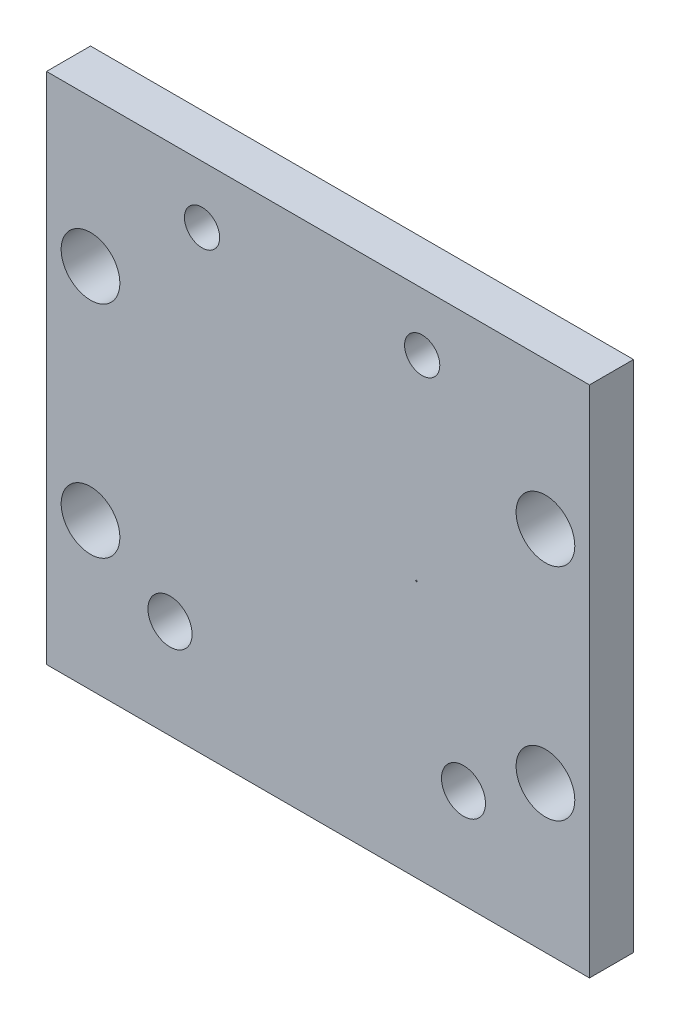
ISO-10303-21;
HEADER;
FILE_DESCRIPTION(('STEP AP214'),'2;1');
FILE_NAME('part.step','',(''),(''),'','','');
FILE_SCHEMA(('AUTOMOTIVE_DESIGN { 1 0 10303 214 1 1 1 1 }'));
ENDSEC;
DATA;
#1=APPLICATION_CONTEXT('core data for automotive mechanical design processes');
#2=APPLICATION_PROTOCOL_DEFINITION('international standard','automotive_design',2000,#1);
#3=PRODUCT_CONTEXT('',#1,'mechanical');
#4=PRODUCT('Part','Part','',(#3));
#5=PRODUCT_RELATED_PRODUCT_CATEGORY('part','',(#4));
#6=PRODUCT_DEFINITION_FORMATION('','',#4);
#7=PRODUCT_DEFINITION_CONTEXT('part definition',#1,'design');
#8=PRODUCT_DEFINITION('design','',#6,#7);
#9=PRODUCT_DEFINITION_SHAPE('','',#8);
#10=(LENGTH_UNIT() NAMED_UNIT(*) SI_UNIT(.MILLI.,.METRE.));
#11=(NAMED_UNIT(*) PLANE_ANGLE_UNIT() SI_UNIT($,.RADIAN.));
#12=(NAMED_UNIT(*) SI_UNIT($,.STERADIAN.) SOLID_ANGLE_UNIT());
#13=UNCERTAINTY_MEASURE_WITH_UNIT(LENGTH_MEASURE(1.E-05),#10,'distance_accuracy_value','');
#14=(GEOMETRIC_REPRESENTATION_CONTEXT(3) GLOBAL_UNCERTAINTY_ASSIGNED_CONTEXT((#13)) GLOBAL_UNIT_ASSIGNED_CONTEXT((#10,
#11,#12)) REPRESENTATION_CONTEXT('',''));
#15=CARTESIAN_POINT('',(0.,0.,0.));
#16=DIRECTION('',(0.,0.,1.));
#17=DIRECTION('',(1.,0.,0.));
#18=AXIS2_PLACEMENT_3D('',#15,#16,#17);
#19=CARTESIAN_POINT('',(0.,0.,3.));
#20=DIRECTION('',(0.,0.,1.));
#21=DIRECTION('',(1.,0.,0.));
#22=AXIS2_PLACEMENT_3D('',#19,#20,#21);
#23=PLANE('',#22);
#24=CARTESIAN_POINT('',(15.530567593757,13.4226152549705,3.));
#25=DIRECTION('',(0.,0.,1.));
#26=DIRECTION('',(1.,0.,0.));
#27=AXIS2_PLACEMENT_3D('',#24,#25,#26);
#28=CIRCLE('',#27,2.00000000000001);
#29=CARTESIAN_POINT('',(17.530567593757,13.4226152549705,3.));
#30=VERTEX_POINT('',#29);
#31=EDGE_CURVE('E251',#30,#30,#28,.T.);
#32=ORIENTED_EDGE('',*,*,#31,.F.);
#33=EDGE_LOOP('',(#32));
#34=FACE_BOUND('',#33,.T.);
#35=CARTESIAN_POINT('',(-15.469432406243,-1.57738474502937,3.));
#36=DIRECTION('',(0.,0.,1.));
#37=DIRECTION('',(1.,0.,0.));
#38=AXIS2_PLACEMENT_3D('',#35,#36,#37);
#39=CIRCLE('',#38,2.);
#40=CARTESIAN_POINT('',(-13.469432406243,-1.57738474502937,3.));
#41=VERTEX_POINT('',#40);
#42=EDGE_CURVE('E239',#41,#41,#39,.T.);
#43=ORIENTED_EDGE('',*,*,#42,.F.);
#44=EDGE_LOOP('',(#43));
#45=FACE_BOUND('',#44,.T.);
#46=CARTESIAN_POINT('',(-10.0520086322193,-4.83112105532809,3.));
#47=DIRECTION('',(0.,0.,1.));
#48=DIRECTION('',(1.,0.,0.));
#49=AXIS2_PLACEMENT_3D('',#46,#47,#48);
#50=CIRCLE('',#49,1.50448530752092);
#51=CARTESIAN_POINT('',(-8.54752332469836,-4.83112105532809,3.));
#52=VERTEX_POINT('',#51);
#53=EDGE_CURVE('E227',#52,#52,#50,.T.);
#54=ORIENTED_EDGE('',*,*,#53,.F.);
#55=EDGE_LOOP('',(#54));
#56=FACE_BOUND('',#55,.T.);
#57=CARTESIAN_POINT('',(6.74024303062548,5.95383545522397,3.));
#58=DIRECTION('',(0.,0.,1.));
#59=DIRECTION('',(1.,0.,0.));
#60=AXIS2_PLACEMENT_3D('',#57,#58,#59);
#61=CIRCLE('',#60,0.0509233955750272);
#62=CARTESIAN_POINT('',(6.79116642620051,5.95383545522397,3.));
#63=VERTEX_POINT('',#62);
#64=EDGE_CURVE('E215',#63,#63,#61,.T.);
#65=ORIENTED_EDGE('',*,*,#64,.F.);
#66=EDGE_LOOP('',(#65));
#67=FACE_BOUND('',#66,.T.);
#68=DIRECTION('',(0.,-1.,0.));
#69=VECTOR('',#68,1.);
#70=CARTESIAN_POINT('',(-18.469432406243,23.4226152549706,3.));
#71=LINE('',#70,#69);
#72=CARTESIAN_POINT('',(-18.469432406243,23.4226152549706,3.));
#73=VERTEX_POINT('',#72);
#74=CARTESIAN_POINT('',(-18.469432406243,-11.5773847450294,3.));
#75=VERTEX_POINT('',#74);
#76=EDGE_CURVE('E185',#73,#75,#71,.T.);
#77=ORIENTED_EDGE('',*,*,#76,.T.);
#78=DIRECTION('',(1.,0.,0.));
#79=VECTOR('',#78,1.);
#80=CARTESIAN_POINT('',(-18.469432406243,-11.5773847450294,3.));
#81=LINE('',#80,#79);
#82=CARTESIAN_POINT('',(18.530567593757,-11.5773847450294,3.));
#83=VERTEX_POINT('',#82);
#84=EDGE_CURVE('E180',#75,#83,#81,.T.);
#85=ORIENTED_EDGE('',*,*,#84,.T.);
#86=DIRECTION('',(0.,1.,0.));
#87=VECTOR('',#86,1.);
#88=CARTESIAN_POINT('',(18.530567593757,23.4226152549706,3.));
#89=LINE('',#88,#87);
#90=CARTESIAN_POINT('',(18.530567593757,23.4226152549706,3.));
#91=VERTEX_POINT('',#90);
#92=EDGE_CURVE('E183',#83,#91,#89,.T.);
#93=ORIENTED_EDGE('',*,*,#92,.T.);
#94=DIRECTION('',(-1.,0.,0.));
#95=VECTOR('',#94,1.);
#96=CARTESIAN_POINT('',(-18.469432406243,23.4226152549706,3.));
#97=LINE('',#96,#95);
#98=EDGE_CURVE('E150',#91,#73,#97,.T.);
#99=ORIENTED_EDGE('',*,*,#98,.T.);
#100=EDGE_LOOP('',(#77,#85,#93,#99));
#101=FACE_BOUND('',#100,.T.);
#102=CARTESIAN_POINT('',(9.94550984229239,-4.827384745008,3.));
#103=DIRECTION('',(0.,0.,1.));
#104=DIRECTION('',(1.,0.,0.));
#105=AXIS2_PLACEMENT_3D('',#102,#103,#104);
#106=CIRCLE('',#105,1.50000000000049);
#107=CARTESIAN_POINT('',(11.4455098422929,-4.827384745008,3.));
#108=VERTEX_POINT('',#107);
#109=EDGE_CURVE('E200',#108,#108,#106,.T.);
#110=ORIENTED_EDGE('',*,*,#109,.F.);
#111=EDGE_LOOP('',(#110));
#112=FACE_BOUND('',#111,.T.);
#113=CARTESIAN_POINT('',(-7.86915790590484,19.50835897612,3.));
#114=DIRECTION('',(0.,0.,1.));
#115=DIRECTION('',(1.,0.,0.));
#116=AXIS2_PLACEMENT_3D('',#113,#114,#115);
#117=CIRCLE('',#116,1.2);
#118=CARTESIAN_POINT('',(-6.66915790590485,19.50835897612,3.));
#119=VERTEX_POINT('',#118);
#120=EDGE_CURVE('E221',#119,#119,#117,.T.);
#121=ORIENTED_EDGE('',*,*,#120,.F.);
#122=EDGE_LOOP('',(#121));
#123=FACE_BOUND('',#122,.T.);
#124=CARTESIAN_POINT('',(7.13080155187816,19.4734839869981,3.));
#125=DIRECTION('',(0.,0.,1.));
#126=DIRECTION('',(1.,0.,0.));
#127=AXIS2_PLACEMENT_3D('',#124,#125,#126);
#128=CIRCLE('',#127,1.2);
#129=CARTESIAN_POINT('',(8.33080155187816,19.4734839869981,3.));
#130=VERTEX_POINT('',#129);
#131=EDGE_CURVE('E233',#130,#130,#128,.T.);
#132=ORIENTED_EDGE('',*,*,#131,.F.);
#133=EDGE_LOOP('',(#132));
#134=FACE_BOUND('',#133,.T.);
#135=CARTESIAN_POINT('',(15.5305675937571,-1.57738474502939,3.));
#136=DIRECTION('',(0.,0.,1.));
#137=DIRECTION('',(1.,0.,0.));
#138=AXIS2_PLACEMENT_3D('',#135,#136,#137);
#139=CIRCLE('',#138,2.);
#140=CARTESIAN_POINT('',(17.5305675937571,-1.57738474502939,3.));
#141=VERTEX_POINT('',#140);
#142=EDGE_CURVE('E245',#141,#141,#139,.T.);
#143=ORIENTED_EDGE('',*,*,#142,.F.);
#144=EDGE_LOOP('',(#143));
#145=FACE_BOUND('',#144,.T.);
#146=CARTESIAN_POINT('',(-15.469432406243,13.4226152549705,3.));
#147=DIRECTION('',(0.,0.,1.));
#148=DIRECTION('',(1.,0.,0.));
#149=AXIS2_PLACEMENT_3D('',#146,#147,#148);
#150=CIRCLE('',#149,2.);
#151=CARTESIAN_POINT('',(-13.469432406243,13.4226152549705,3.));
#152=VERTEX_POINT('',#151);
#153=EDGE_CURVE('E257',#152,#152,#150,.T.);
#154=ORIENTED_EDGE('',*,*,#153,.F.);
#155=EDGE_LOOP('',(#154));
#156=FACE_BOUND('',#155,.T.);
#157=ADVANCED_FACE('F133',(#34,#45,#56,#67,#101,#112,#123,#134,#145,#156),#23,.T.);
#158=CARTESIAN_POINT('',(0.,0.,0.));
#159=DIRECTION('',(0.,0.,1.));
#160=DIRECTION('',(1.,0.,0.));
#161=AXIS2_PLACEMENT_3D('',#158,#159,#160);
#162=PLANE('',#161);
#163=DIRECTION('',(0.,-1.,0.));
#164=VECTOR('',#163,1.);
#165=CARTESIAN_POINT('',(-18.469432406243,23.4226152549706,0.));
#166=LINE('',#165,#164);
#167=CARTESIAN_POINT('',(-18.469432406243,23.4226152549706,0.));
#168=VERTEX_POINT('',#167);
#169=CARTESIAN_POINT('',(-18.469432406243,-11.5773847450294,0.));
#170=VERTEX_POINT('',#169);
#171=EDGE_CURVE('E197',#168,#170,#166,.T.);
#172=ORIENTED_EDGE('',*,*,#171,.F.);
#173=DIRECTION('',(-1.,0.,0.));
#174=VECTOR('',#173,1.);
#175=CARTESIAN_POINT('',(-18.469432406243,23.4226152549706,0.));
#176=LINE('',#175,#174);
#177=CARTESIAN_POINT('',(18.530567593757,23.4226152549706,0.));
#178=VERTEX_POINT('',#177);
#179=EDGE_CURVE('E173',#178,#168,#176,.T.);
#180=ORIENTED_EDGE('',*,*,#179,.F.);
#181=DIRECTION('',(0.,1.,0.));
#182=VECTOR('',#181,1.);
#183=CARTESIAN_POINT('',(18.530567593757,23.4226152549706,0.));
#184=LINE('',#183,#182);
#185=CARTESIAN_POINT('',(18.530567593757,-11.5773847450294,0.));
#186=VERTEX_POINT('',#185);
#187=EDGE_CURVE('E167',#186,#178,#184,.T.);
#188=ORIENTED_EDGE('',*,*,#187,.F.);
#189=DIRECTION('',(1.,0.,0.));
#190=VECTOR('',#189,1.);
#191=CARTESIAN_POINT('',(-18.469432406243,-11.5773847450294,0.));
#192=LINE('',#191,#190);
#193=EDGE_CURVE('E189',#170,#186,#192,.T.);
#194=ORIENTED_EDGE('',*,*,#193,.F.);
#195=EDGE_LOOP('',(#172,#180,#188,#194));
#196=FACE_BOUND('',#195,.T.);
#197=CARTESIAN_POINT('',(9.94550984229239,-4.827384745008,0.));
#198=DIRECTION('',(0.,0.,1.));
#199=DIRECTION('',(1.,0.,0.));
#200=AXIS2_PLACEMENT_3D('',#197,#198,#199);
#201=CIRCLE('',#200,1.50000000000049);
#202=CARTESIAN_POINT('',(11.4455098422929,-4.827384745008,0.));
#203=VERTEX_POINT('',#202);
#204=EDGE_CURVE('E212',#203,#203,#201,.T.);
#205=ORIENTED_EDGE('',*,*,#204,.T.);
#206=EDGE_LOOP('',(#205));
#207=FACE_BOUND('',#206,.T.);
#208=CARTESIAN_POINT('',(6.74024303062548,5.95383545522397,0.));
#209=DIRECTION('',(0.,0.,1.));
#210=DIRECTION('',(1.,0.,0.));
#211=AXIS2_PLACEMENT_3D('',#208,#209,#210);
#212=CIRCLE('',#211,0.0509233955750272);
#213=CARTESIAN_POINT('',(6.79116642620051,5.95383545522397,0.));
#214=VERTEX_POINT('',#213);
#215=EDGE_CURVE('E218',#214,#214,#212,.T.);
#216=ORIENTED_EDGE('',*,*,#215,.T.);
#217=EDGE_LOOP('',(#216));
#218=FACE_BOUND('',#217,.T.);
#219=CARTESIAN_POINT('',(-7.86915790590484,19.50835897612,0.));
#220=DIRECTION('',(0.,0.,1.));
#221=DIRECTION('',(1.,0.,0.));
#222=AXIS2_PLACEMENT_3D('',#219,#220,#221);
#223=CIRCLE('',#222,1.2);
#224=CARTESIAN_POINT('',(-6.66915790590485,19.50835897612,0.));
#225=VERTEX_POINT('',#224);
#226=EDGE_CURVE('E224',#225,#225,#223,.T.);
#227=ORIENTED_EDGE('',*,*,#226,.T.);
#228=EDGE_LOOP('',(#227));
#229=FACE_BOUND('',#228,.T.);
#230=CARTESIAN_POINT('',(-10.0520086322193,-4.83112105532809,0.));
#231=DIRECTION('',(0.,0.,1.));
#232=DIRECTION('',(1.,0.,0.));
#233=AXIS2_PLACEMENT_3D('',#230,#231,#232);
#234=CIRCLE('',#233,1.50448530752092);
#235=CARTESIAN_POINT('',(-8.54752332469836,-4.83112105532809,0.));
#236=VERTEX_POINT('',#235);
#237=EDGE_CURVE('E230',#236,#236,#234,.T.);
#238=ORIENTED_EDGE('',*,*,#237,.T.);
#239=EDGE_LOOP('',(#238));
#240=FACE_BOUND('',#239,.T.);
#241=CARTESIAN_POINT('',(7.13080155187816,19.4734839869981,0.));
#242=DIRECTION('',(0.,0.,1.));
#243=DIRECTION('',(1.,0.,0.));
#244=AXIS2_PLACEMENT_3D('',#241,#242,#243);
#245=CIRCLE('',#244,1.2);
#246=CARTESIAN_POINT('',(8.33080155187816,19.4734839869981,0.));
#247=VERTEX_POINT('',#246);
#248=EDGE_CURVE('E236',#247,#247,#245,.T.);
#249=ORIENTED_EDGE('',*,*,#248,.T.);
#250=EDGE_LOOP('',(#249));
#251=FACE_BOUND('',#250,.T.);
#252=CARTESIAN_POINT('',(-15.469432406243,-1.57738474502937,0.));
#253=DIRECTION('',(0.,0.,1.));
#254=DIRECTION('',(1.,0.,0.));
#255=AXIS2_PLACEMENT_3D('',#252,#253,#254);
#256=CIRCLE('',#255,2.);
#257=CARTESIAN_POINT('',(-13.469432406243,-1.57738474502937,0.));
#258=VERTEX_POINT('',#257);
#259=EDGE_CURVE('E242',#258,#258,#256,.T.);
#260=ORIENTED_EDGE('',*,*,#259,.T.);
#261=EDGE_LOOP('',(#260));
#262=FACE_BOUND('',#261,.T.);
#263=CARTESIAN_POINT('',(15.5305675937571,-1.57738474502939,0.));
#264=DIRECTION('',(0.,0.,1.));
#265=DIRECTION('',(1.,0.,0.));
#266=AXIS2_PLACEMENT_3D('',#263,#264,#265);
#267=CIRCLE('',#266,2.);
#268=CARTESIAN_POINT('',(17.5305675937571,-1.57738474502939,0.));
#269=VERTEX_POINT('',#268);
#270=EDGE_CURVE('E248',#269,#269,#267,.T.);
#271=ORIENTED_EDGE('',*,*,#270,.T.);
#272=EDGE_LOOP('',(#271));
#273=FACE_BOUND('',#272,.T.);
#274=CARTESIAN_POINT('',(15.530567593757,13.4226152549705,0.));
#275=DIRECTION('',(0.,0.,1.));
#276=DIRECTION('',(1.,0.,0.));
#277=AXIS2_PLACEMENT_3D('',#274,#275,#276);
#278=CIRCLE('',#277,2.00000000000001);
#279=CARTESIAN_POINT('',(17.530567593757,13.4226152549705,0.));
#280=VERTEX_POINT('',#279);
#281=EDGE_CURVE('E254',#280,#280,#278,.T.);
#282=ORIENTED_EDGE('',*,*,#281,.T.);
#283=EDGE_LOOP('',(#282));
#284=FACE_BOUND('',#283,.T.);
#285=CARTESIAN_POINT('',(-15.469432406243,13.4226152549705,0.));
#286=DIRECTION('',(0.,0.,1.));
#287=DIRECTION('',(1.,0.,0.));
#288=AXIS2_PLACEMENT_3D('',#285,#286,#287);
#289=CIRCLE('',#288,2.);
#290=CARTESIAN_POINT('',(-13.469432406243,13.4226152549705,0.));
#291=VERTEX_POINT('',#290);
#292=EDGE_CURVE('E260',#291,#291,#289,.T.);
#293=ORIENTED_EDGE('',*,*,#292,.T.);
#294=EDGE_LOOP('',(#293));
#295=FACE_BOUND('',#294,.T.);
#296=ADVANCED_FACE('F208',(#196,#207,#218,#229,#240,#251,#262,#273,#284,#295),#162,.F.);
#297=CARTESIAN_POINT('',(-18.469432406243,23.4226152549706,3.));
#298=DIRECTION('',(1.,0.,0.));
#299=DIRECTION('',(0.,1.,0.));
#300=AXIS2_PLACEMENT_3D('',#297,#298,#299);
#301=PLANE('',#300);
#302=ORIENTED_EDGE('',*,*,#171,.T.);
#303=DIRECTION('',(0.,0.,-1.));
#304=VECTOR('',#303,1.);
#305=CARTESIAN_POINT('',(-18.469432406243,-11.5773847450294,3.));
#306=LINE('',#305,#304);
#307=EDGE_CURVE('E13',#75,#170,#306,.T.);
#308=ORIENTED_EDGE('',*,*,#307,.F.);
#309=ORIENTED_EDGE('',*,*,#76,.F.);
#310=DIRECTION('',(0.,0.,-1.));
#311=VECTOR('',#310,1.);
#312=CARTESIAN_POINT('',(-18.469432406243,23.4226152549706,3.));
#313=LINE('',#312,#311);
#314=EDGE_CURVE('E193',#73,#168,#313,.T.);
#315=ORIENTED_EDGE('',*,*,#314,.T.);
#316=EDGE_LOOP('',(#302,#308,#309,#315));
#317=FACE_BOUND('',#316,.T.);
#318=ADVANCED_FACE('F135',(#317),#301,.F.);
#319=CARTESIAN_POINT('',(-18.469432406243,-11.5773847450294,3.));
#320=DIRECTION('',(0.,1.,0.));
#321=DIRECTION('',(0.,0.,1.));
#322=AXIS2_PLACEMENT_3D('',#319,#320,#321);
#323=PLANE('',#322);
#324=ORIENTED_EDGE('',*,*,#193,.T.);
#325=DIRECTION('',(0.,0.,-1.));
#326=VECTOR('',#325,1.);
#327=CARTESIAN_POINT('',(18.530567593757,-11.5773847450294,3.));
#328=LINE('',#327,#326);
#329=EDGE_CURVE('E142',#83,#186,#328,.T.);
#330=ORIENTED_EDGE('',*,*,#329,.F.);
#331=ORIENTED_EDGE('',*,*,#84,.F.);
#332=ORIENTED_EDGE('',*,*,#307,.T.);
#333=EDGE_LOOP('',(#324,#330,#331,#332));
#334=FACE_BOUND('',#333,.T.);
#335=ADVANCED_FACE('F188',(#334),#323,.F.);
#336=CARTESIAN_POINT('',(18.530567593757,23.4226152549706,3.));
#337=DIRECTION('',(-1.,0.,0.));
#338=DIRECTION('',(0.,-1.,0.));
#339=AXIS2_PLACEMENT_3D('',#336,#337,#338);
#340=PLANE('',#339);
#341=ORIENTED_EDGE('',*,*,#187,.T.);
#342=DIRECTION('',(0.,0.,-1.));
#343=VECTOR('',#342,1.);
#344=CARTESIAN_POINT('',(18.530567593757,23.4226152549706,3.));
#345=LINE('',#344,#343);
#346=EDGE_CURVE('E190',#91,#178,#345,.T.);
#347=ORIENTED_EDGE('',*,*,#346,.F.);
#348=ORIENTED_EDGE('',*,*,#92,.F.);
#349=ORIENTED_EDGE('',*,*,#329,.T.);
#350=EDGE_LOOP('',(#341,#347,#348,#349));
#351=FACE_BOUND('',#350,.T.);
#352=ADVANCED_FACE('F191',(#351),#340,.F.);
#353=CARTESIAN_POINT('',(-18.469432406243,23.4226152549706,3.));
#354=DIRECTION('',(0.,-1.,0.));
#355=DIRECTION('',(0.,0.,-1.));
#356=AXIS2_PLACEMENT_3D('',#353,#354,#355);
#357=PLANE('',#356);
#358=ORIENTED_EDGE('',*,*,#179,.T.);
#359=ORIENTED_EDGE('',*,*,#314,.F.);
#360=ORIENTED_EDGE('',*,*,#98,.F.);
#361=ORIENTED_EDGE('',*,*,#346,.T.);
#362=EDGE_LOOP('',(#358,#359,#360,#361));
#363=FACE_BOUND('',#362,.T.);
#364=ADVANCED_FACE('F205',(#363),#357,.F.);
#365=CARTESIAN_POINT('',(9.94550984229239,-4.827384745008,3.));
#366=DIRECTION('',(0.,0.,-1.));
#367=DIRECTION('',(-1.,0.,0.));
#368=AXIS2_PLACEMENT_3D('',#365,#366,#367);
#369=CYLINDRICAL_SURFACE('',#368,1.50000000000049);
#370=ORIENTED_EDGE('',*,*,#109,.T.);
#371=EDGE_LOOP('',(#370));
#372=FACE_BOUND('',#371,.T.);
#373=ORIENTED_EDGE('',*,*,#204,.F.);
#374=EDGE_LOOP('',(#373));
#375=FACE_BOUND('',#374,.T.);
#376=ADVANCED_FACE('F279',(#372,#375),#369,.F.);
#377=CARTESIAN_POINT('',(6.74024303062548,5.95383545522397,3.));
#378=DIRECTION('',(0.,0.,-1.));
#379=DIRECTION('',(-1.,0.,0.));
#380=AXIS2_PLACEMENT_3D('',#377,#378,#379);
#381=CYLINDRICAL_SURFACE('',#380,0.0509233955750272);
#382=ORIENTED_EDGE('',*,*,#64,.T.);
#383=EDGE_LOOP('',(#382));
#384=FACE_BOUND('',#383,.T.);
#385=ORIENTED_EDGE('',*,*,#215,.F.);
#386=EDGE_LOOP('',(#385));
#387=FACE_BOUND('',#386,.T.);
#388=ADVANCED_FACE('F333',(#384,#387),#381,.F.);
#389=CARTESIAN_POINT('',(-7.86915790590484,19.50835897612,3.));
#390=DIRECTION('',(0.,0.,-1.));
#391=DIRECTION('',(-1.,0.,0.));
#392=AXIS2_PLACEMENT_3D('',#389,#390,#391);
#393=CYLINDRICAL_SURFACE('',#392,1.2);
#394=ORIENTED_EDGE('',*,*,#120,.T.);
#395=EDGE_LOOP('',(#394));
#396=FACE_BOUND('',#395,.T.);
#397=ORIENTED_EDGE('',*,*,#226,.F.);
#398=EDGE_LOOP('',(#397));
#399=FACE_BOUND('',#398,.T.);
#400=ADVANCED_FACE('F342',(#396,#399),#393,.F.);
#401=CARTESIAN_POINT('',(-10.0520086322193,-4.83112105532809,3.));
#402=DIRECTION('',(0.,0.,-1.));
#403=DIRECTION('',(-1.,0.,0.));
#404=AXIS2_PLACEMENT_3D('',#401,#402,#403);
#405=CYLINDRICAL_SURFACE('',#404,1.50448530752092);
#406=ORIENTED_EDGE('',*,*,#53,.T.);
#407=EDGE_LOOP('',(#406));
#408=FACE_BOUND('',#407,.T.);
#409=ORIENTED_EDGE('',*,*,#237,.F.);
#410=EDGE_LOOP('',(#409));
#411=FACE_BOUND('',#410,.T.);
#412=ADVANCED_FACE('F351',(#408,#411),#405,.F.);
#413=CARTESIAN_POINT('',(7.13080155187816,19.4734839869981,3.));
#414=DIRECTION('',(0.,0.,-1.));
#415=DIRECTION('',(-1.,0.,0.));
#416=AXIS2_PLACEMENT_3D('',#413,#414,#415);
#417=CYLINDRICAL_SURFACE('',#416,1.2);
#418=ORIENTED_EDGE('',*,*,#131,.T.);
#419=EDGE_LOOP('',(#418));
#420=FACE_BOUND('',#419,.T.);
#421=ORIENTED_EDGE('',*,*,#248,.F.);
#422=EDGE_LOOP('',(#421));
#423=FACE_BOUND('',#422,.T.);
#424=ADVANCED_FACE('F361',(#420,#423),#417,.F.);
#425=CARTESIAN_POINT('',(-15.469432406243,-1.57738474502937,3.));
#426=DIRECTION('',(0.,0.,-1.));
#427=DIRECTION('',(-1.,0.,0.));
#428=AXIS2_PLACEMENT_3D('',#425,#426,#427);
#429=CYLINDRICAL_SURFACE('',#428,2.);
#430=ORIENTED_EDGE('',*,*,#42,.T.);
#431=EDGE_LOOP('',(#430));
#432=FACE_BOUND('',#431,.T.);
#433=ORIENTED_EDGE('',*,*,#259,.F.);
#434=EDGE_LOOP('',(#433));
#435=FACE_BOUND('',#434,.T.);
#436=ADVANCED_FACE('F371',(#432,#435),#429,.F.);
#437=CARTESIAN_POINT('',(15.5305675937571,-1.57738474502939,3.));
#438=DIRECTION('',(0.,0.,-1.));
#439=DIRECTION('',(-1.,0.,0.));
#440=AXIS2_PLACEMENT_3D('',#437,#438,#439);
#441=CYLINDRICAL_SURFACE('',#440,2.);
#442=ORIENTED_EDGE('',*,*,#142,.T.);
#443=EDGE_LOOP('',(#442));
#444=FACE_BOUND('',#443,.T.);
#445=ORIENTED_EDGE('',*,*,#270,.F.);
#446=EDGE_LOOP('',(#445));
#447=FACE_BOUND('',#446,.T.);
#448=ADVANCED_FACE('F381',(#444,#447),#441,.F.);
#449=CARTESIAN_POINT('',(15.530567593757,13.4226152549705,3.));
#450=DIRECTION('',(0.,0.,-1.));
#451=DIRECTION('',(-1.,0.,0.));
#452=AXIS2_PLACEMENT_3D('',#449,#450,#451);
#453=CYLINDRICAL_SURFACE('',#452,2.00000000000001);
#454=ORIENTED_EDGE('',*,*,#31,.T.);
#455=EDGE_LOOP('',(#454));
#456=FACE_BOUND('',#455,.T.);
#457=ORIENTED_EDGE('',*,*,#281,.F.);
#458=EDGE_LOOP('',(#457));
#459=FACE_BOUND('',#458,.T.);
#460=ADVANCED_FACE('F391',(#456,#459),#453,.F.);
#461=CARTESIAN_POINT('',(-15.469432406243,13.4226152549705,3.));
#462=DIRECTION('',(0.,0.,-1.));
#463=DIRECTION('',(-1.,0.,0.));
#464=AXIS2_PLACEMENT_3D('',#461,#462,#463);
#465=CYLINDRICAL_SURFACE('',#464,2.);
#466=ORIENTED_EDGE('',*,*,#153,.T.);
#467=EDGE_LOOP('',(#466));
#468=FACE_BOUND('',#467,.T.);
#469=ORIENTED_EDGE('',*,*,#292,.F.);
#470=EDGE_LOOP('',(#469));
#471=FACE_BOUND('',#470,.T.);
#472=ADVANCED_FACE('F266',(#468,#471),#465,.F.);
#473=CLOSED_SHELL('',(#157,#296,#318,#335,#352,#364,#376,#388,#400,#412,#424,#436,#448,#460,#472));
#474=MANIFOLD_SOLID_BREP('B2',#473);
#475=ADVANCED_BREP_SHAPE_REPRESENTATION('',(#18,#474),#14);
#476=SHAPE_DEFINITION_REPRESENTATION(#9,#475);
ENDSEC;
END-ISO-10303-21;
